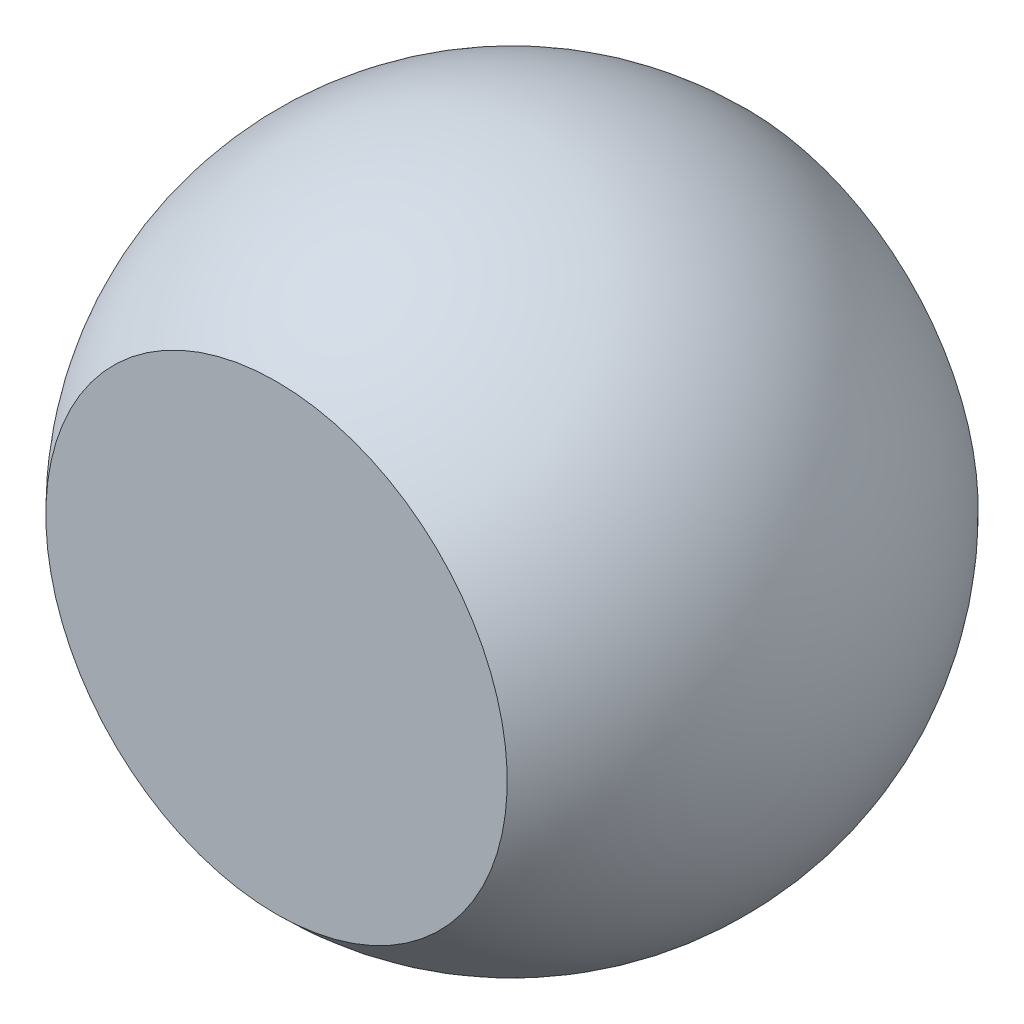
ISO-10303-21;
HEADER;
FILE_DESCRIPTION(('STEP AP214'),'2;1');
FILE_NAME('part.step','',(''),(''),'','','');
FILE_SCHEMA(('AUTOMOTIVE_DESIGN { 1 0 10303 214 1 1 1 1 }'));
ENDSEC;
DATA;
#1=APPLICATION_CONTEXT('core data for automotive mechanical design processes');
#2=APPLICATION_PROTOCOL_DEFINITION('international standard','automotive_design',2000,#1);
#3=PRODUCT_CONTEXT('',#1,'mechanical');
#4=PRODUCT('Part','Part','',(#3));
#5=PRODUCT_RELATED_PRODUCT_CATEGORY('part','',(#4));
#6=PRODUCT_DEFINITION_FORMATION('','',#4);
#7=PRODUCT_DEFINITION_CONTEXT('part definition',#1,'design');
#8=PRODUCT_DEFINITION('design','',#6,#7);
#9=PRODUCT_DEFINITION_SHAPE('','',#8);
#10=(LENGTH_UNIT() NAMED_UNIT(*) SI_UNIT(.MILLI.,.METRE.));
#11=(NAMED_UNIT(*) PLANE_ANGLE_UNIT() SI_UNIT($,.RADIAN.));
#12=(NAMED_UNIT(*) SI_UNIT($,.STERADIAN.) SOLID_ANGLE_UNIT());
#13=UNCERTAINTY_MEASURE_WITH_UNIT(LENGTH_MEASURE(1.E-05),#10,'distance_accuracy_value','');
#14=(GEOMETRIC_REPRESENTATION_CONTEXT(3) GLOBAL_UNCERTAINTY_ASSIGNED_CONTEXT((#13)) GLOBAL_UNIT_ASSIGNED_CONTEXT((#10,
#11,#12)) REPRESENTATION_CONTEXT('',''));
#15=CARTESIAN_POINT('',(0.,0.,0.));
#16=DIRECTION('',(0.,0.,1.));
#17=DIRECTION('',(1.,0.,0.));
#18=AXIS2_PLACEMENT_3D('',#15,#16,#17);
#19=CARTESIAN_POINT('',(0.,0.,0.));
#20=DIRECTION('',(0.,0.,-1.));
#21=DIRECTION('',(1.,0.,0.));
#22=AXIS2_PLACEMENT_3D('',#19,#20,#21);
#23=SPHERICAL_SURFACE('',#22,0.35);
#24=CARTESIAN_POINT('',(0.,0.,-0.25));
#25=DIRECTION('',(0.,0.,1.));
#26=DIRECTION('',(0.,-1.,0.));
#27=AXIS2_PLACEMENT_3D('',#24,#25,#26);
#28=CIRCLE('',#27,0.244948974278318);
#29=CARTESIAN_POINT('',(0.,-0.244948974278318,-0.25));
#30=VERTEX_POINT('',#29);
#31=EDGE_CURVE('E10',#30,#30,#28,.F.);
#32=ORIENTED_EDGE('',*,*,#31,.F.);
#33=EDGE_LOOP('',(#32));
#34=FACE_BOUND('',#33,.T.);
#35=CARTESIAN_POINT('',(0.,0.,0.25));
#36=DIRECTION('',(0.,0.,1.));
#37=DIRECTION('',(0.,-1.,0.));
#38=AXIS2_PLACEMENT_3D('',#35,#36,#37);
#39=CIRCLE('',#38,0.244948974278318);
#40=CARTESIAN_POINT('',(0.,-0.244948974278318,0.25));
#41=VERTEX_POINT('',#40);
#42=EDGE_CURVE('E35',#41,#41,#39,.F.);
#43=ORIENTED_EDGE('',*,*,#42,.T.);
#44=EDGE_LOOP('',(#43));
#45=FACE_BOUND('',#44,.T.);
#46=ADVANCED_FACE('F32',(#34,#45),#23,.T.);
#47=CARTESIAN_POINT('',(-5.,0.610453938045189,-0.25));
#48=DIRECTION('',(0.,0.,1.));
#49=DIRECTION('',(0.,-1.,0.));
#50=AXIS2_PLACEMENT_3D('',#47,#48,#49);
#51=PLANE('',#50);
#52=ORIENTED_EDGE('',*,*,#31,.T.);
#53=EDGE_LOOP('',(#52));
#54=FACE_BOUND('',#53,.T.);
#55=ADVANCED_FACE('F47',(#54),#51,.F.);
#56=CARTESIAN_POINT('',(-5.,0.610453938045189,0.25));
#57=DIRECTION('',(0.,0.,1.));
#58=DIRECTION('',(0.,-1.,0.));
#59=AXIS2_PLACEMENT_3D('',#56,#57,#58);
#60=PLANE('',#59);
#61=ORIENTED_EDGE('',*,*,#42,.F.);
#62=EDGE_LOOP('',(#61));
#63=FACE_BOUND('',#62,.T.);
#64=ADVANCED_FACE('F45',(#63),#60,.T.);
#65=CLOSED_SHELL('',(#46,#55,#64));
#66=MANIFOLD_SOLID_BREP('B2',#65);
#67=ADVANCED_BREP_SHAPE_REPRESENTATION('',(#18,#66),#14);
#68=SHAPE_DEFINITION_REPRESENTATION(#9,#67);
ENDSEC;
END-ISO-10303-21;
